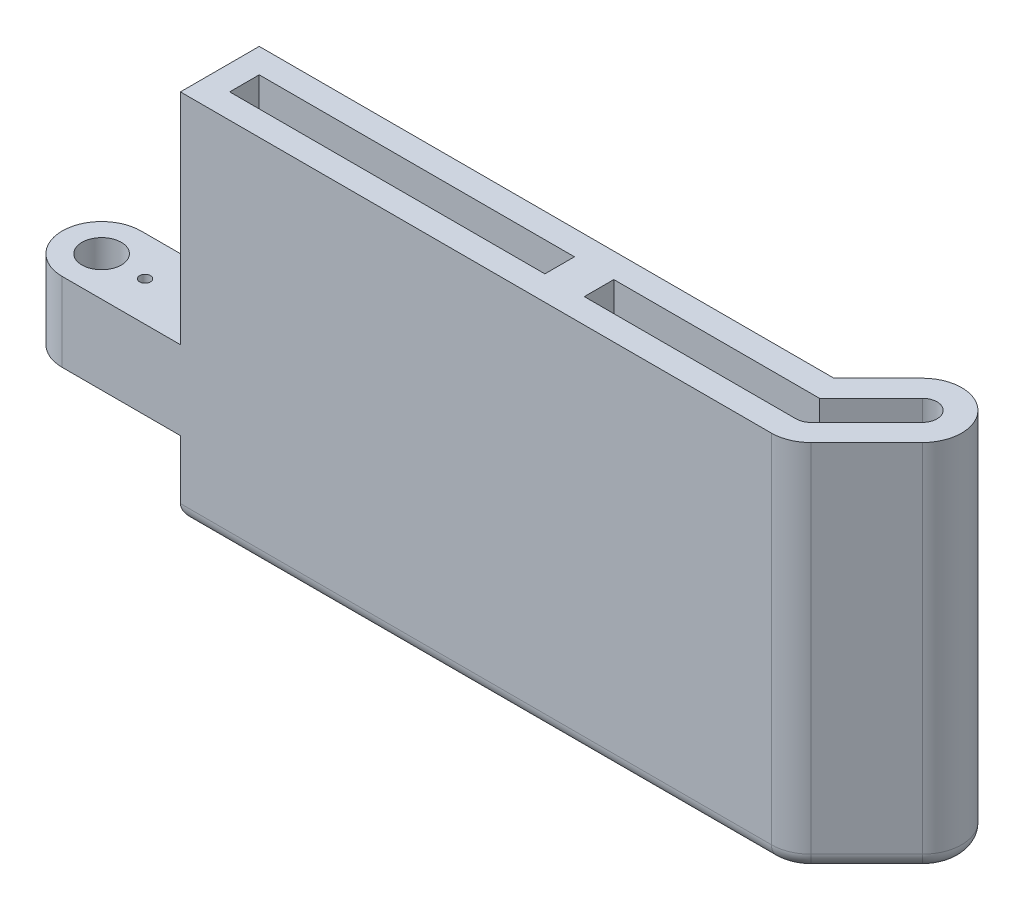
ISO-10303-21;
HEADER;
FILE_DESCRIPTION(('STEP AP214'),'2;1');
FILE_NAME('part.step','',(''),(''),'','','');
FILE_SCHEMA(('AUTOMOTIVE_DESIGN { 1 0 10303 214 1 1 1 1 }'));
ENDSEC;
DATA;
#1=APPLICATION_CONTEXT('core data for automotive mechanical design processes');
#2=APPLICATION_PROTOCOL_DEFINITION('international standard','automotive_design',2000,#1);
#3=PRODUCT_CONTEXT('',#1,'mechanical');
#4=PRODUCT('Part','Part','',(#3));
#5=PRODUCT_RELATED_PRODUCT_CATEGORY('part','',(#4));
#6=PRODUCT_DEFINITION_FORMATION('','',#4);
#7=PRODUCT_DEFINITION_CONTEXT('part definition',#1,'design');
#8=PRODUCT_DEFINITION('design','',#6,#7);
#9=PRODUCT_DEFINITION_SHAPE('','',#8);
#10=(LENGTH_UNIT() NAMED_UNIT(*) SI_UNIT(.MILLI.,.METRE.));
#11=(NAMED_UNIT(*) PLANE_ANGLE_UNIT() SI_UNIT($,.RADIAN.));
#12=(NAMED_UNIT(*) SI_UNIT($,.STERADIAN.) SOLID_ANGLE_UNIT());
#13=UNCERTAINTY_MEASURE_WITH_UNIT(LENGTH_MEASURE(1.E-05),#10,'distance_accuracy_value','');
#14=(GEOMETRIC_REPRESENTATION_CONTEXT(3) GLOBAL_UNCERTAINTY_ASSIGNED_CONTEXT((#13)) GLOBAL_UNIT_ASSIGNED_CONTEXT((#10,
#11,#12)) REPRESENTATION_CONTEXT('',''));
#15=CARTESIAN_POINT('',(0.,0.,0.));
#16=DIRECTION('',(0.,0.,1.));
#17=DIRECTION('',(1.,0.,0.));
#18=AXIS2_PLACEMENT_3D('',#15,#16,#17);
#19=CARTESIAN_POINT('',(61.6401280605348,59.999999888,61.6401280605346));
#20=DIRECTION('',(0.707106781186549,0.,0.707106781186546));
#21=DIRECTION('',(-0.707106781186546,0.,0.707106781186549));
#22=AXIS2_PLACEMENT_3D('',#19,#20,#21);
#23=PLANE('',#22);
#24=DIRECTION('',(0.,-1.,0.));
#25=VECTOR('',#24,1.);
#26=CARTESIAN_POINT('',(127.770384181604,59.999999888,-4.49012806053458));
#27=LINE('',#26,#25);
#28=CARTESIAN_POINT('',(127.770384181604,59.999999888,-4.49012806053458));
#29=VERTEX_POINT('',#28);
#30=CARTESIAN_POINT('',(127.770384181604,2.54,-4.49012806053458));
#31=VERTEX_POINT('',#30);
#32=EDGE_CURVE('E374',#29,#31,#27,.T.);
#33=ORIENTED_EDGE('',*,*,#32,.F.);
#34=DIRECTION('',(0.707106781186546,0.,-0.707106781186549));
#35=VECTOR('',#34,1.);
#36=CARTESIAN_POINT('',(61.6401280605348,59.999999888,61.6401280605346));
#37=LINE('',#36,#35);
#38=CARTESIAN_POINT('',(118.790128060535,59.999999888,4.49012806053457));
#39=VERTEX_POINT('',#38);
#40=EDGE_CURVE('E358',#39,#29,#37,.T.);
#41=ORIENTED_EDGE('',*,*,#40,.F.);
#42=DIRECTION('',(0.,-1.,0.));
#43=VECTOR('',#42,1.);
#44=CARTESIAN_POINT('',(118.790128060535,59.999999888,4.49012806053457));
#45=LINE('',#44,#43);
#46=CARTESIAN_POINT('',(118.790128060535,2.54,4.49012806053457));
#47=VERTEX_POINT('',#46);
#48=EDGE_CURVE('E392',#39,#47,#45,.T.);
#49=ORIENTED_EDGE('',*,*,#48,.T.);
#50=DIRECTION('',(0.707106781186546,0.,-0.707106781186549));
#51=VECTOR('',#50,1.);
#52=CARTESIAN_POINT('',(118.790128060535,2.54,4.49012806053457));
#53=LINE('',#52,#51);
#54=EDGE_CURVE('E429',#31,#47,#53,.F.);
#55=ORIENTED_EDGE('',*,*,#54,.F.);
#56=EDGE_LOOP('',(#33,#41,#49,#55));
#57=FACE_BOUND('',#56,.T.);
#58=ADVANCED_FACE('F41',(#57),#23,.T.);
#59=CARTESIAN_POINT('',(114.3,59.999999888,0.));
#60=DIRECTION('',(0.,-1.,0.));
#61=DIRECTION('',(0.,0.,1.));
#62=AXIS2_PLACEMENT_3D('',#59,#60,#61);
#63=CYLINDRICAL_SURFACE('',#62,6.35);
#64=ORIENTED_EDGE('',*,*,#48,.F.);
#65=CARTESIAN_POINT('',(114.3,59.999999888,0.));
#66=DIRECTION('',(0.,-1.,0.));
#67=DIRECTION('',(0.,0.,-1.));
#68=AXIS2_PLACEMENT_3D('',#65,#66,#67);
#69=CIRCLE('',#68,6.35);
#70=CARTESIAN_POINT('',(114.3,59.999999888,6.35));
#71=VERTEX_POINT('',#70);
#72=EDGE_CURVE('E361',#39,#71,#69,.T.);
#73=ORIENTED_EDGE('',*,*,#72,.T.);
#74=DIRECTION('',(0.,-1.,0.));
#75=VECTOR('',#74,1.);
#76=CARTESIAN_POINT('',(114.3,59.999999888,6.35));
#77=LINE('',#76,#75);
#78=CARTESIAN_POINT('',(114.3,2.54,6.35));
#79=VERTEX_POINT('',#78);
#80=EDGE_CURVE('E389',#71,#79,#77,.T.);
#81=ORIENTED_EDGE('',*,*,#80,.T.);
#82=CARTESIAN_POINT('',(114.3,2.54,0.));
#83=DIRECTION('',(0.,-1.,0.));
#84=DIRECTION('',(0.,0.,-1.));
#85=AXIS2_PLACEMENT_3D('',#82,#83,#84);
#86=CIRCLE('',#85,6.35);
#87=EDGE_CURVE('E426',#47,#79,#86,.T.);
#88=ORIENTED_EDGE('',*,*,#87,.F.);
#89=EDGE_LOOP('',(#64,#73,#81,#88));
#90=FACE_BOUND('',#89,.T.);
#91=ADVANCED_FACE('F489',(#90),#63,.T.);
#92=CARTESIAN_POINT('',(0.,59.999999888,6.35));
#93=DIRECTION('',(0.,0.,1.));
#94=DIRECTION('',(-1.,0.,0.));
#95=AXIS2_PLACEMENT_3D('',#92,#93,#94);
#96=PLANE('',#95);
#97=ORIENTED_EDGE('',*,*,#80,.F.);
#98=DIRECTION('',(1.,0.,0.));
#99=VECTOR('',#98,1.);
#100=CARTESIAN_POINT('',(0.,59.999999888,6.35));
#101=LINE('',#100,#99);
#102=CARTESIAN_POINT('',(19.05,59.999999888,6.35));
#103=VERTEX_POINT('',#102);
#104=EDGE_CURVE('E364',#103,#71,#101,.T.);
#105=ORIENTED_EDGE('',*,*,#104,.F.);
#106=DIRECTION('',(0.,1.,0.));
#107=VECTOR('',#106,1.);
#108=CARTESIAN_POINT('',(19.05,59.999999888,6.35));
#109=LINE('',#108,#107);
#110=CARTESIAN_POINT('',(19.05,24.717000096,6.35));
#111=VERTEX_POINT('',#110);
#112=EDGE_CURVE('E340',#111,#103,#109,.T.);
#113=ORIENTED_EDGE('',*,*,#112,.F.);
#114=DIRECTION('',(1.,0.,0.));
#115=VECTOR('',#114,1.);
#116=CARTESIAN_POINT('',(-6.34999999999999,24.717000096,6.35));
#117=LINE('',#116,#115);
#118=CARTESIAN_POINT('',(0.,24.717000096,6.35));
#119=VERTEX_POINT('',#118);
#120=EDGE_CURVE('E347',#119,#111,#117,.T.);
#121=ORIENTED_EDGE('',*,*,#120,.F.);
#122=DIRECTION('',(0.,-1.,0.));
#123=VECTOR('',#122,1.);
#124=CARTESIAN_POINT('',(0.,59.999999888,6.35));
#125=LINE('',#124,#123);
#126=CARTESIAN_POINT('',(0.,12.017000096,6.35));
#127=VERTEX_POINT('',#126);
#128=EDGE_CURVE('E386',#119,#127,#125,.T.);
#129=ORIENTED_EDGE('',*,*,#128,.T.);
#130=DIRECTION('',(-1.,0.,0.));
#131=VECTOR('',#130,1.);
#132=CARTESIAN_POINT('',(-6.35,12.017000096,6.35));
#133=LINE('',#132,#131);
#134=CARTESIAN_POINT('',(19.05,12.017000096,6.35));
#135=VERTEX_POINT('',#134);
#136=EDGE_CURVE('E326',#135,#127,#133,.T.);
#137=ORIENTED_EDGE('',*,*,#136,.F.);
#138=DIRECTION('',(0.,1.,0.));
#139=VECTOR('',#138,1.);
#140=CARTESIAN_POINT('',(19.05,12.017000096,6.35));
#141=LINE('',#140,#139);
#142=CARTESIAN_POINT('',(19.05,2.54,6.35));
#143=VERTEX_POINT('',#142);
#144=EDGE_CURVE('E323',#143,#135,#141,.T.);
#145=ORIENTED_EDGE('',*,*,#144,.F.);
#146=DIRECTION('',(1.,0.,0.));
#147=VECTOR('',#146,1.);
#148=CARTESIAN_POINT('',(19.05,2.54,6.35));
#149=LINE('',#148,#147);
#150=EDGE_CURVE('E432',#79,#143,#149,.F.);
#151=ORIENTED_EDGE('',*,*,#150,.F.);
#152=EDGE_LOOP('',(#97,#105,#113,#121,#129,#137,#145,#151));
#153=FACE_BOUND('',#152,.T.);
#154=ADVANCED_FACE('F461',(#153),#96,.T.);
#155=CARTESIAN_POINT('',(0.,59.999999888,0.));
#156=DIRECTION('',(0.,-1.,0.));
#157=DIRECTION('',(0.,0.,1.));
#158=AXIS2_PLACEMENT_3D('',#155,#156,#157);
#159=CYLINDRICAL_SURFACE('',#158,6.35);
#160=ORIENTED_EDGE('',*,*,#128,.F.);
#161=CARTESIAN_POINT('',(0.,24.717000096,0.));
#162=DIRECTION('',(0.,1.,0.));
#163=DIRECTION('',(1.,0.,0.));
#164=AXIS2_PLACEMENT_3D('',#161,#162,#163);
#165=CIRCLE('',#164,6.35);
#166=CARTESIAN_POINT('',(0.,24.717000096,-6.35));
#167=VERTEX_POINT('',#166);
#168=EDGE_CURVE('E337',#167,#119,#165,.T.);
#169=ORIENTED_EDGE('',*,*,#168,.F.);
#170=DIRECTION('',(0.,-1.,0.));
#171=VECTOR('',#170,1.);
#172=CARTESIAN_POINT('',(0.,59.999999888,-6.35));
#173=LINE('',#172,#171);
#174=CARTESIAN_POINT('',(0.,12.017000096,-6.35));
#175=VERTEX_POINT('',#174);
#176=EDGE_CURVE('E383',#167,#175,#173,.T.);
#177=ORIENTED_EDGE('',*,*,#176,.T.);
#178=CARTESIAN_POINT('',(0.,12.017000096,0.));
#179=DIRECTION('',(0.,-1.,0.));
#180=DIRECTION('',(0.,0.,-1.));
#181=AXIS2_PLACEMENT_3D('',#178,#179,#180);
#182=CIRCLE('',#181,6.35);
#183=EDGE_CURVE('E355',#127,#175,#182,.T.);
#184=ORIENTED_EDGE('',*,*,#183,.F.);
#185=EDGE_LOOP('',(#160,#169,#177,#184));
#186=FACE_BOUND('',#185,.T.);
#187=ADVANCED_FACE('F504',(#186),#159,.T.);
#188=CARTESIAN_POINT('',(0.,59.999999888,-6.35));
#189=DIRECTION('',(0.,0.,1.));
#190=DIRECTION('',(-1.,0.,0.));
#191=AXIS2_PLACEMENT_3D('',#188,#189,#190);
#192=PLANE('',#191);
#193=DIRECTION('',(0.,1.,0.));
#194=VECTOR('',#193,1.);
#195=CARTESIAN_POINT('',(19.05,12.017000096,-6.35));
#196=LINE('',#195,#194);
#197=CARTESIAN_POINT('',(19.05,2.54,-6.35));
#198=VERTEX_POINT('',#197);
#199=CARTESIAN_POINT('',(19.05,12.017000096,-6.35));
#200=VERTEX_POINT('',#199);
#201=EDGE_CURVE('E331',#198,#200,#196,.T.);
#202=ORIENTED_EDGE('',*,*,#201,.T.);
#203=DIRECTION('',(-1.,0.,0.));
#204=VECTOR('',#203,1.);
#205=CARTESIAN_POINT('',(-6.35,12.017000096,-6.35));
#206=LINE('',#205,#204);
#207=EDGE_CURVE('E327',#200,#175,#206,.T.);
#208=ORIENTED_EDGE('',*,*,#207,.T.);
#209=ORIENTED_EDGE('',*,*,#176,.F.);
#210=DIRECTION('',(1.,0.,0.));
#211=VECTOR('',#210,1.);
#212=CARTESIAN_POINT('',(-6.34999999999999,24.717000096,-6.35));
#213=LINE('',#212,#211);
#214=CARTESIAN_POINT('',(19.05,24.717000096,-6.35));
#215=VERTEX_POINT('',#214);
#216=EDGE_CURVE('E334',#167,#215,#213,.T.);
#217=ORIENTED_EDGE('',*,*,#216,.T.);
#218=DIRECTION('',(0.,1.,0.));
#219=VECTOR('',#218,1.);
#220=CARTESIAN_POINT('',(19.05,59.999999888,-6.35));
#221=LINE('',#220,#219);
#222=CARTESIAN_POINT('',(19.05,59.999999888,-6.35));
#223=VERTEX_POINT('',#222);
#224=EDGE_CURVE('E344',#215,#223,#221,.T.);
#225=ORIENTED_EDGE('',*,*,#224,.T.);
#226=DIRECTION('',(1.,0.,0.));
#227=VECTOR('',#226,1.);
#228=CARTESIAN_POINT('',(0.,59.999999888,-6.35));
#229=LINE('',#228,#227);
#230=CARTESIAN_POINT('',(111.669743878931,59.999999888,-6.35));
#231=VERTEX_POINT('',#230);
#232=EDGE_CURVE('E366',#223,#231,#229,.T.);
#233=ORIENTED_EDGE('',*,*,#232,.T.);
#234=DIRECTION('',(0.,-1.,0.));
#235=VECTOR('',#234,1.);
#236=CARTESIAN_POINT('',(111.669743878931,59.999999888,-6.35));
#237=LINE('',#236,#235);
#238=CARTESIAN_POINT('',(111.669743878931,2.54,-6.35));
#239=VERTEX_POINT('',#238);
#240=EDGE_CURVE('E380',#231,#239,#237,.T.);
#241=ORIENTED_EDGE('',*,*,#240,.T.);
#242=DIRECTION('',(1.,0.,0.));
#243=VECTOR('',#242,1.);
#244=CARTESIAN_POINT('',(0.,2.54,-6.35));
#245=LINE('',#244,#243);
#246=EDGE_CURVE('E11',#198,#239,#245,.T.);
#247=ORIENTED_EDGE('',*,*,#246,.F.);
#248=EDGE_LOOP('',(#202,#208,#209,#217,#225,#233,#241,#247));
#249=FACE_BOUND('',#248,.T.);
#250=ADVANCED_FACE('F467',(#249),#192,.F.);
#251=CARTESIAN_POINT('',(52.6598719394656,59.999999888,52.6598719394654));
#252=DIRECTION('',(0.707106781186549,0.,0.707106781186546));
#253=DIRECTION('',(-0.707106781186546,0.,0.707106781186549));
#254=AXIS2_PLACEMENT_3D('',#251,#252,#253);
#255=PLANE('',#254);
#256=ORIENTED_EDGE('',*,*,#240,.F.);
#257=DIRECTION('',(0.707106781186546,0.,-0.707106781186549));
#258=VECTOR('',#257,1.);
#259=CARTESIAN_POINT('',(52.6598719394656,59.999999888,52.6598719394654));
#260=LINE('',#259,#258);
#261=CARTESIAN_POINT('',(118.790128060535,59.999999888,-13.4703841816037));
#262=VERTEX_POINT('',#261);
#263=EDGE_CURVE('E369',#231,#262,#260,.T.);
#264=ORIENTED_EDGE('',*,*,#263,.T.);
#265=DIRECTION('',(0.,-1.,0.));
#266=VECTOR('',#265,1.);
#267=CARTESIAN_POINT('',(118.790128060535,59.999999888,-13.4703841816037));
#268=LINE('',#267,#266);
#269=CARTESIAN_POINT('',(118.790128060535,2.54,-13.4703841816037));
#270=VERTEX_POINT('',#269);
#271=EDGE_CURVE('E377',#262,#270,#268,.T.);
#272=ORIENTED_EDGE('',*,*,#271,.T.);
#273=DIRECTION('',(0.707106781186546,0.,-0.707106781186549));
#274=VECTOR('',#273,1.);
#275=CARTESIAN_POINT('',(52.6598719394656,2.54,52.6598719394654));
#276=LINE('',#275,#274);
#277=EDGE_CURVE('E423',#239,#270,#276,.T.);
#278=ORIENTED_EDGE('',*,*,#277,.F.);
#279=EDGE_LOOP('',(#256,#264,#272,#278));
#280=FACE_BOUND('',#279,.T.);
#281=ADVANCED_FACE('F473',(#280),#255,.F.);
#282=CARTESIAN_POINT('',(123.280256121069,59.999999888,-8.98025612106917));
#283=DIRECTION('',(0.,-1.,0.));
#284=DIRECTION('',(0.,0.,1.));
#285=AXIS2_PLACEMENT_3D('',#282,#283,#284);
#286=CYLINDRICAL_SURFACE('',#285,6.35);
#287=ORIENTED_EDGE('',*,*,#271,.F.);
#288=CARTESIAN_POINT('',(123.280256121069,59.999999888,-8.98025612106917));
#289=DIRECTION('',(0.,-1.,0.));
#290=DIRECTION('',(0.,0.,-1.));
#291=AXIS2_PLACEMENT_3D('',#288,#289,#290);
#292=CIRCLE('',#291,6.35);
#293=EDGE_CURVE('E372',#262,#29,#292,.T.);
#294=ORIENTED_EDGE('',*,*,#293,.T.);
#295=ORIENTED_EDGE('',*,*,#32,.T.);
#296=CARTESIAN_POINT('',(123.280256121069,2.54,-8.98025612106917));
#297=DIRECTION('',(0.,-1.,0.));
#298=DIRECTION('',(0.,0.,-1.));
#299=AXIS2_PLACEMENT_3D('',#296,#297,#298);
#300=CIRCLE('',#299,6.35);
#301=EDGE_CURVE('E395',#270,#31,#300,.T.);
#302=ORIENTED_EDGE('',*,*,#301,.F.);
#303=EDGE_LOOP('',(#287,#294,#295,#302));
#304=FACE_BOUND('',#303,.T.);
#305=ADVANCED_FACE('F600',(#304),#286,.T.);
#306=CARTESIAN_POINT('',(0.,59.999999888,0.));
#307=DIRECTION('',(0.,1.,0.));
#308=DIRECTION('',(0.,0.,-1.));
#309=AXIS2_PLACEMENT_3D('',#306,#307,#308);
#310=PLANE('',#309);
#311=CARTESIAN_POINT('',(114.3,59.999999888,0.));
#312=DIRECTION('',(0.,-1.,0.));
#313=DIRECTION('',(0.,0.,-1.));
#314=AXIS2_PLACEMENT_3D('',#311,#312,#313);
#315=CIRCLE('',#314,2.38125000000001);
#316=CARTESIAN_POINT('',(115.9837980227,59.999999888,1.68379802270046));
#317=VERTEX_POINT('',#316);
#318=CARTESIAN_POINT('',(114.3,59.999999888,2.38125));
#319=VERTEX_POINT('',#318);
#320=EDGE_CURVE('E253',#317,#319,#315,.T.);
#321=ORIENTED_EDGE('',*,*,#320,.T.);
#322=DIRECTION('',(-1.,0.,0.));
#323=VECTOR('',#322,1.);
#324=CARTESIAN_POINT('',(114.3,59.999999888,2.38125));
#325=LINE('',#324,#323);
#326=CARTESIAN_POINT('',(80.16875,59.999999888,2.38125));
#327=VERTEX_POINT('',#326);
#328=EDGE_CURVE('E219',#319,#327,#325,.T.);
#329=ORIENTED_EDGE('',*,*,#328,.T.);
#330=DIRECTION('',(0.,0.,-1.));
#331=VECTOR('',#330,1.);
#332=CARTESIAN_POINT('',(80.16875,59.999999888,2.38125));
#333=LINE('',#332,#331);
#334=CARTESIAN_POINT('',(80.16875,59.999999888,-2.38125));
#335=VERTEX_POINT('',#334);
#336=EDGE_CURVE('E257',#327,#335,#333,.T.);
#337=ORIENTED_EDGE('',*,*,#336,.T.);
#338=DIRECTION('',(1.,0.,0.));
#339=VECTOR('',#338,1.);
#340=CARTESIAN_POINT('',(80.16875,59.999999888,-2.38125));
#341=LINE('',#340,#339);
#342=CARTESIAN_POINT('',(113.313653954599,59.999999888,-2.38125));
#343=VERTEX_POINT('',#342);
#344=EDGE_CURVE('E260',#335,#343,#341,.T.);
#345=ORIENTED_EDGE('',*,*,#344,.T.);
#346=DIRECTION('',(0.707106781186547,0.,-0.707106781186548));
#347=VECTOR('',#346,1.);
#348=CARTESIAN_POINT('',(113.313653954599,59.999999888,-2.38125));
#349=LINE('',#348,#347);
#350=CARTESIAN_POINT('',(121.596458098369,59.999999888,-10.6640541437696));
#351=VERTEX_POINT('',#350);
#352=EDGE_CURVE('E263',#343,#351,#349,.T.);
#353=ORIENTED_EDGE('',*,*,#352,.T.);
#354=CARTESIAN_POINT('',(123.280256121069,59.999999888,-8.98025612106917));
#355=DIRECTION('',(0.,-1.,0.));
#356=DIRECTION('',(0.,0.,-1.));
#357=AXIS2_PLACEMENT_3D('',#354,#355,#356);
#358=CIRCLE('',#357,2.38124999999998);
#359=CARTESIAN_POINT('',(124.96405414377,59.999999888,-7.2964580983687));
#360=VERTEX_POINT('',#359);
#361=EDGE_CURVE('E266',#351,#360,#358,.T.);
#362=ORIENTED_EDGE('',*,*,#361,.T.);
#363=DIRECTION('',(-0.707106781186545,0.,0.70710678118655));
#364=VECTOR('',#363,1.);
#365=CARTESIAN_POINT('',(124.96405414377,59.999999888,-7.2964580983687));
#366=LINE('',#365,#364);
#367=EDGE_CURVE('E233',#360,#317,#366,.T.);
#368=ORIENTED_EDGE('',*,*,#367,.T.);
#369=EDGE_LOOP('',(#321,#329,#337,#345,#353,#362,#368));
#370=FACE_BOUND('',#369,.T.);
#371=DIRECTION('',(-1.,0.,0.));
#372=VECTOR('',#371,1.);
#373=CARTESIAN_POINT('',(73.81875,59.999999888,2.38125));
#374=LINE('',#373,#372);
#375=CARTESIAN_POINT('',(73.81875,59.999999888,2.38125));
#376=VERTEX_POINT('',#375);
#377=CARTESIAN_POINT('',(23.01875,59.999999888,2.38125));
#378=VERTEX_POINT('',#377);
#379=EDGE_CURVE('E255',#376,#378,#374,.T.);
#380=ORIENTED_EDGE('',*,*,#379,.T.);
#381=DIRECTION('',(0.,0.,-1.));
#382=VECTOR('',#381,1.);
#383=CARTESIAN_POINT('',(23.01875,59.999999888,2.38125));
#384=LINE('',#383,#382);
#385=CARTESIAN_POINT('',(23.01875,59.999999888,-2.38125));
#386=VERTEX_POINT('',#385);
#387=EDGE_CURVE('E298',#378,#386,#384,.T.);
#388=ORIENTED_EDGE('',*,*,#387,.T.);
#389=DIRECTION('',(1.,0.,0.));
#390=VECTOR('',#389,1.);
#391=CARTESIAN_POINT('',(23.01875,59.999999888,-2.38125));
#392=LINE('',#391,#390);
#393=CARTESIAN_POINT('',(73.81875,59.999999888,-2.38125));
#394=VERTEX_POINT('',#393);
#395=EDGE_CURVE('E294',#386,#394,#392,.T.);
#396=ORIENTED_EDGE('',*,*,#395,.T.);
#397=DIRECTION('',(0.,0.,1.));
#398=VECTOR('',#397,1.);
#399=CARTESIAN_POINT('',(73.81875,59.999999888,2.38125));
#400=LINE('',#399,#398);
#401=EDGE_CURVE('E291',#394,#376,#400,.T.);
#402=ORIENTED_EDGE('',*,*,#401,.T.);
#403=EDGE_LOOP('',(#380,#388,#396,#402));
#404=FACE_BOUND('',#403,.T.);
#405=DIRECTION('',(0.,0.,-1.));
#406=VECTOR('',#405,1.);
#407=CARTESIAN_POINT('',(19.05,59.999999888,6.35));
#408=LINE('',#407,#406);
#409=EDGE_CURVE('E341',#103,#223,#408,.T.);
#410=ORIENTED_EDGE('',*,*,#409,.F.);
#411=ORIENTED_EDGE('',*,*,#104,.T.);
#412=ORIENTED_EDGE('',*,*,#72,.F.);
#413=ORIENTED_EDGE('',*,*,#40,.T.);
#414=ORIENTED_EDGE('',*,*,#293,.F.);
#415=ORIENTED_EDGE('',*,*,#263,.F.);
#416=ORIENTED_EDGE('',*,*,#232,.F.);
#417=EDGE_LOOP('',(#410,#411,#412,#413,#414,#415,#416));
#418=FACE_BOUND('',#417,.T.);
#419=ADVANCED_FACE('F495',(#370,#404,#418),#310,.T.);
#420=CARTESIAN_POINT('',(0.,0.,0.));
#421=DIRECTION('',(0.,1.,0.));
#422=DIRECTION('',(0.,0.,-1.));
#423=AXIS2_PLACEMENT_3D('',#420,#421,#422);
#424=PLANE('',#423);
#425=CARTESIAN_POINT('',(114.3,0.,0.));
#426=DIRECTION('',(0.,-1.,0.));
#427=DIRECTION('',(0.,0.,-1.));
#428=AXIS2_PLACEMENT_3D('',#425,#426,#427);
#429=CIRCLE('',#428,3.81);
#430=CARTESIAN_POINT('',(114.3,0.,3.81));
#431=VERTEX_POINT('',#430);
#432=CARTESIAN_POINT('',(116.994076836321,0.,2.69407683632074));
#433=VERTEX_POINT('',#432);
#434=EDGE_CURVE('E411',#431,#433,#429,.F.);
#435=ORIENTED_EDGE('',*,*,#434,.F.);
#436=DIRECTION('',(1.,0.,0.));
#437=VECTOR('',#436,1.);
#438=CARTESIAN_POINT('',(114.3,0.,3.81));
#439=LINE('',#438,#437);
#440=CARTESIAN_POINT('',(21.59,0.,3.81));
#441=VERTEX_POINT('',#440);
#442=EDGE_CURVE('E408',#441,#431,#439,.T.);
#443=ORIENTED_EDGE('',*,*,#442,.F.);
#444=DIRECTION('',(0.,0.,-1.));
#445=VECTOR('',#444,1.);
#446=CARTESIAN_POINT('',(21.59,0.,0.));
#447=LINE('',#446,#445);
#448=CARTESIAN_POINT('',(21.59,0.,-3.81));
#449=VERTEX_POINT('',#448);
#450=EDGE_CURVE('E406',#449,#441,#447,.F.);
#451=ORIENTED_EDGE('',*,*,#450,.F.);
#452=DIRECTION('',(1.,0.,0.));
#453=VECTOR('',#452,1.);
#454=CARTESIAN_POINT('',(0.,0.,-3.81));
#455=LINE('',#454,#453);
#456=CARTESIAN_POINT('',(112.721846327359,0.,-3.81));
#457=VERTEX_POINT('',#456);
#458=EDGE_CURVE('E404',#457,#449,#455,.F.);
#459=ORIENTED_EDGE('',*,*,#458,.F.);
#460=DIRECTION('',(0.707106781186546,0.,-0.707106781186549));
#461=VECTOR('',#460,1.);
#462=CARTESIAN_POINT('',(54.4559231636795,0.,54.4559231636793));
#463=LINE('',#462,#461);
#464=CARTESIAN_POINT('',(120.586179284748,0.,-11.6743329573899));
#465=VERTEX_POINT('',#464);
#466=EDGE_CURVE('E414',#465,#457,#463,.F.);
#467=ORIENTED_EDGE('',*,*,#466,.F.);
#468=CARTESIAN_POINT('',(123.280256121069,0.,-8.98025612106917));
#469=DIRECTION('',(0.,-1.,0.));
#470=DIRECTION('',(0.,0.,-1.));
#471=AXIS2_PLACEMENT_3D('',#468,#469,#470);
#472=CIRCLE('',#471,3.81);
#473=CARTESIAN_POINT('',(125.97433295739,0.,-6.28617928474842));
#474=VERTEX_POINT('',#473);
#475=EDGE_CURVE('E417',#474,#465,#472,.F.);
#476=ORIENTED_EDGE('',*,*,#475,.F.);
#477=DIRECTION('',(0.707106781186546,0.,-0.707106781186549));
#478=VECTOR('',#477,1.);
#479=CARTESIAN_POINT('',(125.97433295739,0.,-6.28617928474841));
#480=LINE('',#479,#478);
#481=EDGE_CURVE('E420',#433,#474,#480,.T.);
#482=ORIENTED_EDGE('',*,*,#481,.F.);
#483=EDGE_LOOP('',(#435,#443,#451,#459,#467,#476,#482));
#484=FACE_BOUND('',#483,.T.);
#485=DIRECTION('',(-0.707106781186545,0.,0.70710678118655));
#486=VECTOR('',#485,1.);
#487=CARTESIAN_POINT('',(124.96405414377,0.,-7.2964580983687));
#488=LINE('',#487,#486);
#489=CARTESIAN_POINT('',(124.96405414377,0.,-7.2964580983687));
#490=VERTEX_POINT('',#489);
#491=CARTESIAN_POINT('',(115.9837980227,0.,1.68379802270046));
#492=VERTEX_POINT('',#491);
#493=EDGE_CURVE('E224',#490,#492,#488,.T.);
#494=ORIENTED_EDGE('',*,*,#493,.F.);
#495=CARTESIAN_POINT('',(123.280256121069,0.,-8.98025612106917));
#496=DIRECTION('',(0.,-1.,0.));
#497=DIRECTION('',(0.,0.,-1.));
#498=AXIS2_PLACEMENT_3D('',#495,#496,#497);
#499=CIRCLE('',#498,2.38124999999998);
#500=CARTESIAN_POINT('',(121.596458098369,0.,-10.6640541437696));
#501=VERTEX_POINT('',#500);
#502=EDGE_CURVE('E249',#501,#490,#499,.T.);
#503=ORIENTED_EDGE('',*,*,#502,.F.);
#504=DIRECTION('',(0.707106781186547,0.,-0.707106781186548));
#505=VECTOR('',#504,1.);
#506=CARTESIAN_POINT('',(113.313653954599,0.,-2.38125));
#507=LINE('',#506,#505);
#508=CARTESIAN_POINT('',(113.313653954599,0.,-2.38125));
#509=VERTEX_POINT('',#508);
#510=EDGE_CURVE('E246',#509,#501,#507,.T.);
#511=ORIENTED_EDGE('',*,*,#510,.F.);
#512=DIRECTION('',(1.,0.,0.));
#513=VECTOR('',#512,1.);
#514=CARTESIAN_POINT('',(80.16875,0.,-2.38125));
#515=LINE('',#514,#513);
#516=CARTESIAN_POINT('',(80.16875,0.,-2.38125));
#517=VERTEX_POINT('',#516);
#518=EDGE_CURVE('E241',#517,#509,#515,.T.);
#519=ORIENTED_EDGE('',*,*,#518,.F.);
#520=DIRECTION('',(0.,0.,-1.));
#521=VECTOR('',#520,1.);
#522=CARTESIAN_POINT('',(80.16875,0.,2.38125));
#523=LINE('',#522,#521);
#524=CARTESIAN_POINT('',(80.16875,0.,2.38125));
#525=VERTEX_POINT('',#524);
#526=EDGE_CURVE('E239',#525,#517,#523,.T.);
#527=ORIENTED_EDGE('',*,*,#526,.F.);
#528=DIRECTION('',(-1.,0.,0.));
#529=VECTOR('',#528,1.);
#530=CARTESIAN_POINT('',(114.3,0.,2.38125));
#531=LINE('',#530,#529);
#532=CARTESIAN_POINT('',(114.3,0.,2.38125));
#533=VERTEX_POINT('',#532);
#534=EDGE_CURVE('E216',#533,#525,#531,.T.);
#535=ORIENTED_EDGE('',*,*,#534,.F.);
#536=CARTESIAN_POINT('',(114.3,0.,0.));
#537=DIRECTION('',(0.,-1.,0.));
#538=DIRECTION('',(0.,0.,-1.));
#539=AXIS2_PLACEMENT_3D('',#536,#537,#538);
#540=CIRCLE('',#539,2.38125000000001);
#541=EDGE_CURVE('E227',#492,#533,#540,.T.);
#542=ORIENTED_EDGE('',*,*,#541,.F.);
#543=EDGE_LOOP('',(#494,#503,#511,#519,#527,#535,#542));
#544=FACE_BOUND('',#543,.T.);
#545=DIRECTION('',(0.,0.,1.));
#546=VECTOR('',#545,1.);
#547=CARTESIAN_POINT('',(73.81875,0.,2.38125));
#548=LINE('',#547,#546);
#549=CARTESIAN_POINT('',(73.81875,0.,-2.38125));
#550=VERTEX_POINT('',#549);
#551=CARTESIAN_POINT('',(73.81875,0.,2.38125));
#552=VERTEX_POINT('',#551);
#553=EDGE_CURVE('E284',#550,#552,#548,.T.);
#554=ORIENTED_EDGE('',*,*,#553,.F.);
#555=DIRECTION('',(1.,0.,0.));
#556=VECTOR('',#555,1.);
#557=CARTESIAN_POINT('',(23.01875,0.,-2.38125));
#558=LINE('',#557,#556);
#559=CARTESIAN_POINT('',(23.01875,0.,-2.38125));
#560=VERTEX_POINT('',#559);
#561=EDGE_CURVE('E305',#560,#550,#558,.T.);
#562=ORIENTED_EDGE('',*,*,#561,.F.);
#563=DIRECTION('',(0.,0.,-1.));
#564=VECTOR('',#563,1.);
#565=CARTESIAN_POINT('',(23.01875,0.,2.38125));
#566=LINE('',#565,#564);
#567=CARTESIAN_POINT('',(23.01875,0.,2.38125));
#568=VERTEX_POINT('',#567);
#569=EDGE_CURVE('E308',#568,#560,#566,.T.);
#570=ORIENTED_EDGE('',*,*,#569,.F.);
#571=DIRECTION('',(-1.,0.,0.));
#572=VECTOR('',#571,1.);
#573=CARTESIAN_POINT('',(73.81875,0.,2.38125));
#574=LINE('',#573,#572);
#575=EDGE_CURVE('E295',#552,#568,#574,.T.);
#576=ORIENTED_EDGE('',*,*,#575,.F.);
#577=EDGE_LOOP('',(#554,#562,#570,#576));
#578=FACE_BOUND('',#577,.T.);
#579=ADVANCED_FACE('F235',(#484,#544,#578),#424,.F.);
#580=CARTESIAN_POINT('',(-6.35,12.017000096,6.35));
#581=DIRECTION('',(0.,1.,0.));
#582=DIRECTION('',(0.,0.,-1.));
#583=AXIS2_PLACEMENT_3D('',#580,#581,#582);
#584=PLANE('',#583);
#585=CARTESIAN_POINT('',(0.,12.017000096,0.));
#586=DIRECTION('',(0.,1.,0.));
#587=DIRECTION('',(0.,0.,1.));
#588=AXIS2_PLACEMENT_3D('',#585,#586,#587);
#589=CIRCLE('',#588,3.175);
#590=CARTESIAN_POINT('',(0.,12.017000096,3.175));
#591=VERTEX_POINT('',#590);
#592=EDGE_CURVE('E272',#591,#591,#589,.T.);
#593=ORIENTED_EDGE('',*,*,#592,.T.);
#594=EDGE_LOOP('',(#593));
#595=FACE_BOUND('',#594,.T.);
#596=CARTESIAN_POINT('',(6.99999997,12.017000096,0.));
#597=DIRECTION('',(0.,1.,0.));
#598=DIRECTION('',(0.,0.,1.));
#599=AXIS2_PLACEMENT_3D('',#596,#597,#598);
#600=CIRCLE('',#599,0.877000024);
#601=CARTESIAN_POINT('',(6.99999997,12.017000096,0.877000024));
#602=VERTEX_POINT('',#601);
#603=EDGE_CURVE('E316',#602,#602,#600,.T.);
#604=ORIENTED_EDGE('',*,*,#603,.T.);
#605=EDGE_LOOP('',(#604));
#606=FACE_BOUND('',#605,.T.);
#607=CARTESIAN_POINT('',(16.000000004,12.017000096,0.));
#608=DIRECTION('',(0.,1.,0.));
#609=DIRECTION('',(0.,0.,1.));
#610=AXIS2_PLACEMENT_3D('',#607,#608,#609);
#611=CIRCLE('',#610,0.877000023999999);
#612=CARTESIAN_POINT('',(16.000000004,12.017000096,0.877000023999999));
#613=VERTEX_POINT('',#612);
#614=EDGE_CURVE('E320',#613,#613,#611,.T.);
#615=ORIENTED_EDGE('',*,*,#614,.T.);
#616=EDGE_LOOP('',(#615));
#617=FACE_BOUND('',#616,.T.);
#618=ORIENTED_EDGE('',*,*,#136,.T.);
#619=ORIENTED_EDGE('',*,*,#183,.T.);
#620=ORIENTED_EDGE('',*,*,#207,.F.);
#621=DIRECTION('',(0.,0.,-1.));
#622=VECTOR('',#621,1.);
#623=CARTESIAN_POINT('',(19.05,12.017000096,6.35));
#624=LINE('',#623,#622);
#625=EDGE_CURVE('E330',#135,#200,#624,.T.);
#626=ORIENTED_EDGE('',*,*,#625,.F.);
#627=EDGE_LOOP('',(#618,#619,#620,#626));
#628=FACE_BOUND('',#627,.T.);
#629=ADVANCED_FACE('F506',(#595,#606,#617,#628),#584,.F.);
#630=CARTESIAN_POINT('',(19.05,12.017000096,6.35));
#631=DIRECTION('',(1.,0.,0.));
#632=DIRECTION('',(0.,1.,0.));
#633=AXIS2_PLACEMENT_3D('',#630,#631,#632);
#634=PLANE('',#633);
#635=ORIENTED_EDGE('',*,*,#144,.T.);
#636=ORIENTED_EDGE('',*,*,#625,.T.);
#637=ORIENTED_EDGE('',*,*,#201,.F.);
#638=DIRECTION('',(0.,0.,-1.));
#639=VECTOR('',#638,1.);
#640=CARTESIAN_POINT('',(19.05,2.54,6.35));
#641=LINE('',#640,#639);
#642=EDGE_CURVE('E50',#143,#198,#641,.T.);
#643=ORIENTED_EDGE('',*,*,#642,.F.);
#644=EDGE_LOOP('',(#635,#636,#637,#643));
#645=FACE_BOUND('',#644,.T.);
#646=ADVANCED_FACE('F463',(#645),#634,.F.);
#647=CARTESIAN_POINT('',(-6.34999999999999,24.717000096,6.35));
#648=DIRECTION('',(0.,-1.,0.));
#649=DIRECTION('',(1.,0.,0.));
#650=AXIS2_PLACEMENT_3D('',#647,#648,#649);
#651=PLANE('',#650);
#652=CARTESIAN_POINT('',(0.,24.717000096,0.));
#653=DIRECTION('',(0.,1.,0.));
#654=DIRECTION('',(1.,0.,0.));
#655=AXIS2_PLACEMENT_3D('',#652,#653,#654);
#656=CIRCLE('',#655,3.175);
#657=CARTESIAN_POINT('',(3.175,24.717000096,0.));
#658=VERTEX_POINT('',#657);
#659=EDGE_CURVE('E315',#658,#658,#656,.T.);
#660=ORIENTED_EDGE('',*,*,#659,.F.);
#661=EDGE_LOOP('',(#660));
#662=FACE_BOUND('',#661,.T.);
#663=CARTESIAN_POINT('',(6.99999997,24.717000096,0.));
#664=DIRECTION('',(0.,1.,0.));
#665=DIRECTION('',(1.,0.,0.));
#666=AXIS2_PLACEMENT_3D('',#663,#664,#665);
#667=CIRCLE('',#666,0.877000024);
#668=CARTESIAN_POINT('',(7.876999994,24.717000096,0.));
#669=VERTEX_POINT('',#668);
#670=EDGE_CURVE('E343',#669,#669,#667,.T.);
#671=ORIENTED_EDGE('',*,*,#670,.F.);
#672=EDGE_LOOP('',(#671));
#673=FACE_BOUND('',#672,.T.);
#674=CARTESIAN_POINT('',(16.000000004,24.717000096,0.));
#675=DIRECTION('',(0.,1.,0.));
#676=DIRECTION('',(1.,0.,0.));
#677=AXIS2_PLACEMENT_3D('',#674,#675,#676);
#678=CIRCLE('',#677,0.877000023999999);
#679=CARTESIAN_POINT('',(16.877000028,24.717000096,0.));
#680=VERTEX_POINT('',#679);
#681=EDGE_CURVE('E319',#680,#680,#678,.T.);
#682=ORIENTED_EDGE('',*,*,#681,.F.);
#683=EDGE_LOOP('',(#682));
#684=FACE_BOUND('',#683,.T.);
#685=ORIENTED_EDGE('',*,*,#216,.F.);
#686=ORIENTED_EDGE('',*,*,#168,.T.);
#687=ORIENTED_EDGE('',*,*,#120,.T.);
#688=DIRECTION('',(0.,0.,-1.));
#689=VECTOR('',#688,1.);
#690=CARTESIAN_POINT('',(19.05,24.717000096,6.35));
#691=LINE('',#690,#689);
#692=EDGE_CURVE('E338',#111,#215,#691,.T.);
#693=ORIENTED_EDGE('',*,*,#692,.T.);
#694=EDGE_LOOP('',(#685,#686,#687,#693));
#695=FACE_BOUND('',#694,.T.);
#696=ADVANCED_FACE('F500',(#662,#673,#684,#695),#651,.F.);
#697=CARTESIAN_POINT('',(19.05,59.999999888,6.35));
#698=DIRECTION('',(1.,0.,0.));
#699=DIRECTION('',(0.,0.,1.));
#700=AXIS2_PLACEMENT_3D('',#697,#698,#699);
#701=PLANE('',#700);
#702=ORIENTED_EDGE('',*,*,#224,.F.);
#703=ORIENTED_EDGE('',*,*,#692,.F.);
#704=ORIENTED_EDGE('',*,*,#112,.T.);
#705=ORIENTED_EDGE('',*,*,#409,.T.);
#706=EDGE_LOOP('',(#702,#703,#704,#705));
#707=FACE_BOUND('',#706,.T.);
#708=ADVANCED_FACE('F498',(#707),#701,.F.);
#709=CARTESIAN_POINT('',(16.000000004,59.999999888,0.));
#710=DIRECTION('',(0.,-1.,0.));
#711=DIRECTION('',(0.,0.,1.));
#712=AXIS2_PLACEMENT_3D('',#709,#710,#711);
#713=CYLINDRICAL_SURFACE('',#712,0.877000023999999);
#714=ORIENTED_EDGE('',*,*,#614,.F.);
#715=EDGE_LOOP('',(#714));
#716=FACE_BOUND('',#715,.T.);
#717=ORIENTED_EDGE('',*,*,#681,.T.);
#718=EDGE_LOOP('',(#717));
#719=FACE_BOUND('',#718,.T.);
#720=ADVANCED_FACE('F579',(#716,#719),#713,.F.);
#721=CARTESIAN_POINT('',(6.99999997,59.999999888,0.));
#722=DIRECTION('',(0.,-1.,0.));
#723=DIRECTION('',(0.,0.,1.));
#724=AXIS2_PLACEMENT_3D('',#721,#722,#723);
#725=CYLINDRICAL_SURFACE('',#724,0.877000024);
#726=ORIENTED_EDGE('',*,*,#603,.F.);
#727=EDGE_LOOP('',(#726));
#728=FACE_BOUND('',#727,.T.);
#729=ORIENTED_EDGE('',*,*,#670,.T.);
#730=EDGE_LOOP('',(#729));
#731=FACE_BOUND('',#730,.T.);
#732=ADVANCED_FACE('F576',(#728,#731),#725,.F.);
#733=CARTESIAN_POINT('',(0.,59.999999888,0.));
#734=DIRECTION('',(0.,-1.,0.));
#735=DIRECTION('',(0.,0.,1.));
#736=AXIS2_PLACEMENT_3D('',#733,#734,#735);
#737=CYLINDRICAL_SURFACE('',#736,3.175);
#738=ORIENTED_EDGE('',*,*,#592,.F.);
#739=EDGE_LOOP('',(#738));
#740=FACE_BOUND('',#739,.T.);
#741=ORIENTED_EDGE('',*,*,#659,.T.);
#742=EDGE_LOOP('',(#741));
#743=FACE_BOUND('',#742,.T.);
#744=ADVANCED_FACE('F562',(#740,#743),#737,.F.);
#745=CARTESIAN_POINT('',(73.81875,0.,2.38125));
#746=DIRECTION('',(0.,0.,1.));
#747=DIRECTION('',(-1.,0.,0.));
#748=AXIS2_PLACEMENT_3D('',#745,#746,#747);
#749=PLANE('',#748);
#750=ORIENTED_EDGE('',*,*,#379,.F.);
#751=DIRECTION('',(0.,1.,0.));
#752=VECTOR('',#751,1.);
#753=CARTESIAN_POINT('',(73.81875,0.,2.38125));
#754=LINE('',#753,#752);
#755=EDGE_CURVE('E289',#552,#376,#754,.T.);
#756=ORIENTED_EDGE('',*,*,#755,.F.);
#757=ORIENTED_EDGE('',*,*,#575,.T.);
#758=DIRECTION('',(0.,1.,0.));
#759=VECTOR('',#758,1.);
#760=CARTESIAN_POINT('',(23.01875,0.,2.38125));
#761=LINE('',#760,#759);
#762=EDGE_CURVE('E282',#568,#378,#761,.T.);
#763=ORIENTED_EDGE('',*,*,#762,.T.);
#764=EDGE_LOOP('',(#750,#756,#757,#763));
#765=FACE_BOUND('',#764,.T.);
#766=ADVANCED_FACE('F558',(#765),#749,.F.);
#767=CARTESIAN_POINT('',(73.81875,0.,2.38125));
#768=DIRECTION('',(1.,0.,0.));
#769=DIRECTION('',(0.,0.,1.));
#770=AXIS2_PLACEMENT_3D('',#767,#768,#769);
#771=PLANE('',#770);
#772=ORIENTED_EDGE('',*,*,#401,.F.);
#773=DIRECTION('',(0.,1.,0.));
#774=VECTOR('',#773,1.);
#775=CARTESIAN_POINT('',(73.81875,0.,-2.38125));
#776=LINE('',#775,#774);
#777=EDGE_CURVE('E287',#550,#394,#776,.T.);
#778=ORIENTED_EDGE('',*,*,#777,.F.);
#779=ORIENTED_EDGE('',*,*,#553,.T.);
#780=ORIENTED_EDGE('',*,*,#755,.T.);
#781=EDGE_LOOP('',(#772,#778,#779,#780));
#782=FACE_BOUND('',#781,.T.);
#783=ADVANCED_FACE('F561',(#782),#771,.F.);
#784=CARTESIAN_POINT('',(23.01875,0.,-2.38125));
#785=DIRECTION('',(0.,0.,-1.));
#786=DIRECTION('',(1.,0.,0.));
#787=AXIS2_PLACEMENT_3D('',#784,#785,#786);
#788=PLANE('',#787);
#789=ORIENTED_EDGE('',*,*,#395,.F.);
#790=DIRECTION('',(0.,1.,0.));
#791=VECTOR('',#790,1.);
#792=CARTESIAN_POINT('',(23.01875,0.,-2.38125));
#793=LINE('',#792,#791);
#794=EDGE_CURVE('E285',#560,#386,#793,.T.);
#795=ORIENTED_EDGE('',*,*,#794,.F.);
#796=ORIENTED_EDGE('',*,*,#561,.T.);
#797=ORIENTED_EDGE('',*,*,#777,.T.);
#798=EDGE_LOOP('',(#789,#795,#796,#797));
#799=FACE_BOUND('',#798,.T.);
#800=ADVANCED_FACE('F566',(#799),#788,.F.);
#801=CARTESIAN_POINT('',(23.01875,0.,2.38125));
#802=DIRECTION('',(-1.,0.,0.));
#803=DIRECTION('',(0.,0.,-1.));
#804=AXIS2_PLACEMENT_3D('',#801,#802,#803);
#805=PLANE('',#804);
#806=ORIENTED_EDGE('',*,*,#387,.F.);
#807=ORIENTED_EDGE('',*,*,#762,.F.);
#808=ORIENTED_EDGE('',*,*,#569,.T.);
#809=ORIENTED_EDGE('',*,*,#794,.T.);
#810=EDGE_LOOP('',(#806,#807,#808,#809));
#811=FACE_BOUND('',#810,.T.);
#812=ADVANCED_FACE('F557',(#811),#805,.F.);
#813=CARTESIAN_POINT('',(114.3,0.,0.));
#814=DIRECTION('',(0.,1.,0.));
#815=DIRECTION('',(0.,0.,-1.));
#816=AXIS2_PLACEMENT_3D('',#813,#814,#815);
#817=CYLINDRICAL_SURFACE('',#816,2.38125000000001);
#818=ORIENTED_EDGE('',*,*,#320,.F.);
#819=DIRECTION('',(0.,1.,0.));
#820=VECTOR('',#819,1.);
#821=CARTESIAN_POINT('',(115.9837980227,0.,1.68379802270046));
#822=LINE('',#821,#820);
#823=EDGE_CURVE('E229',#492,#317,#822,.T.);
#824=ORIENTED_EDGE('',*,*,#823,.F.);
#825=ORIENTED_EDGE('',*,*,#541,.T.);
#826=DIRECTION('',(0.,1.,0.));
#827=VECTOR('',#826,1.);
#828=CARTESIAN_POINT('',(114.3,0.,2.38125));
#829=LINE('',#828,#827);
#830=EDGE_CURVE('E212',#533,#319,#829,.T.);
#831=ORIENTED_EDGE('',*,*,#830,.T.);
#832=EDGE_LOOP('',(#818,#824,#825,#831));
#833=FACE_BOUND('',#832,.T.);
#834=ADVANCED_FACE('F228',(#833),#817,.F.);
#835=CARTESIAN_POINT('',(124.96405414377,0.,-7.2964580983687));
#836=DIRECTION('',(0.70710678118655,0.,0.707106781186545));
#837=DIRECTION('',(-0.707106781186545,0.,0.70710678118655));
#838=AXIS2_PLACEMENT_3D('',#835,#836,#837);
#839=PLANE('',#838);
#840=ORIENTED_EDGE('',*,*,#367,.F.);
#841=DIRECTION('',(0.,1.,0.));
#842=VECTOR('',#841,1.);
#843=CARTESIAN_POINT('',(124.96405414377,0.,-7.2964580983687));
#844=LINE('',#843,#842);
#845=EDGE_CURVE('E273',#490,#360,#844,.T.);
#846=ORIENTED_EDGE('',*,*,#845,.F.);
#847=ORIENTED_EDGE('',*,*,#493,.T.);
#848=ORIENTED_EDGE('',*,*,#823,.T.);
#849=EDGE_LOOP('',(#840,#846,#847,#848));
#850=FACE_BOUND('',#849,.T.);
#851=ADVANCED_FACE('F556',(#850),#839,.F.);
#852=CARTESIAN_POINT('',(123.280256121069,0.,-8.98025612106917));
#853=DIRECTION('',(0.,1.,0.));
#854=DIRECTION('',(0.,0.,-1.));
#855=AXIS2_PLACEMENT_3D('',#852,#853,#854);
#856=CYLINDRICAL_SURFACE('',#855,2.38124999999998);
#857=ORIENTED_EDGE('',*,*,#361,.F.);
#858=DIRECTION('',(0.,1.,0.));
#859=VECTOR('',#858,1.);
#860=CARTESIAN_POINT('',(121.596458098369,0.,-10.6640541437696));
#861=LINE('',#860,#859);
#862=EDGE_CURVE('E275',#501,#351,#861,.T.);
#863=ORIENTED_EDGE('',*,*,#862,.F.);
#864=ORIENTED_EDGE('',*,*,#502,.T.);
#865=ORIENTED_EDGE('',*,*,#845,.T.);
#866=EDGE_LOOP('',(#857,#863,#864,#865));
#867=FACE_BOUND('',#866,.T.);
#868=ADVANCED_FACE('F728',(#867),#856,.F.);
#869=CARTESIAN_POINT('',(113.313653954599,0.,-2.38125));
#870=DIRECTION('',(-0.707106781186548,0.,-0.707106781186547));
#871=DIRECTION('',(0.707106781186547,0.,-0.707106781186548));
#872=AXIS2_PLACEMENT_3D('',#869,#870,#871);
#873=PLANE('',#872);
#874=ORIENTED_EDGE('',*,*,#352,.F.);
#875=DIRECTION('',(0.,1.,0.));
#876=VECTOR('',#875,1.);
#877=CARTESIAN_POINT('',(113.313653954599,0.,-2.38125));
#878=LINE('',#877,#876);
#879=EDGE_CURVE('E277',#509,#343,#878,.T.);
#880=ORIENTED_EDGE('',*,*,#879,.F.);
#881=ORIENTED_EDGE('',*,*,#510,.T.);
#882=ORIENTED_EDGE('',*,*,#862,.T.);
#883=EDGE_LOOP('',(#874,#880,#881,#882));
#884=FACE_BOUND('',#883,.T.);
#885=ADVANCED_FACE('F739',(#884),#873,.F.);
#886=CARTESIAN_POINT('',(80.16875,0.,-2.38125));
#887=DIRECTION('',(0.,0.,-1.));
#888=DIRECTION('',(1.,0.,0.));
#889=AXIS2_PLACEMENT_3D('',#886,#887,#888);
#890=PLANE('',#889);
#891=ORIENTED_EDGE('',*,*,#344,.F.);
#892=DIRECTION('',(0.,1.,0.));
#893=VECTOR('',#892,1.);
#894=CARTESIAN_POINT('',(80.16875,0.,-2.38125));
#895=LINE('',#894,#893);
#896=EDGE_CURVE('E279',#517,#335,#895,.T.);
#897=ORIENTED_EDGE('',*,*,#896,.F.);
#898=ORIENTED_EDGE('',*,*,#518,.T.);
#899=ORIENTED_EDGE('',*,*,#879,.T.);
#900=EDGE_LOOP('',(#891,#897,#898,#899));
#901=FACE_BOUND('',#900,.T.);
#902=ADVANCED_FACE('F549',(#901),#890,.F.);
#903=CARTESIAN_POINT('',(80.16875,0.,2.38125));
#904=DIRECTION('',(-1.,0.,0.));
#905=DIRECTION('',(0.,0.,-1.));
#906=AXIS2_PLACEMENT_3D('',#903,#904,#905);
#907=PLANE('',#906);
#908=ORIENTED_EDGE('',*,*,#336,.F.);
#909=DIRECTION('',(0.,1.,0.));
#910=VECTOR('',#909,1.);
#911=CARTESIAN_POINT('',(80.16875,0.,2.38125));
#912=LINE('',#911,#910);
#913=EDGE_CURVE('E223',#525,#327,#912,.T.);
#914=ORIENTED_EDGE('',*,*,#913,.F.);
#915=ORIENTED_EDGE('',*,*,#526,.T.);
#916=ORIENTED_EDGE('',*,*,#896,.T.);
#917=EDGE_LOOP('',(#908,#914,#915,#916));
#918=FACE_BOUND('',#917,.T.);
#919=ADVANCED_FACE('F544',(#918),#907,.F.);
#920=CARTESIAN_POINT('',(114.3,0.,2.38125));
#921=DIRECTION('',(0.,0.,1.));
#922=DIRECTION('',(-1.,0.,0.));
#923=AXIS2_PLACEMENT_3D('',#920,#921,#922);
#924=PLANE('',#923);
#925=ORIENTED_EDGE('',*,*,#328,.F.);
#926=ORIENTED_EDGE('',*,*,#830,.F.);
#927=ORIENTED_EDGE('',*,*,#534,.T.);
#928=ORIENTED_EDGE('',*,*,#913,.T.);
#929=EDGE_LOOP('',(#925,#926,#927,#928));
#930=FACE_BOUND('',#929,.T.);
#931=ADVANCED_FACE('F214',(#930),#924,.F.);
#932=CARTESIAN_POINT('',(21.59,2.54,6.35));
#933=DIRECTION('',(0.,0.,-1.));
#934=DIRECTION('',(1.,0.,0.));
#935=AXIS2_PLACEMENT_3D('',#932,#933,#934);
#936=CYLINDRICAL_SURFACE('',#935,2.54);
#937=CARTESIAN_POINT('',(21.59,2.54,-3.81));
#938=DIRECTION('',(-0.707106781186547,0.,0.707106781186547));
#939=DIRECTION('',(0.707106781186547,0.,0.707106781186547));
#940=AXIS2_PLACEMENT_3D('',#937,#938,#939);
#941=ELLIPSE('',#940,3.59210244842766,2.54);
#942=EDGE_CURVE('E57',#198,#449,#941,.T.);
#943=ORIENTED_EDGE('',*,*,#942,.T.);
#944=ORIENTED_EDGE('',*,*,#450,.T.);
#945=CARTESIAN_POINT('',(21.59,2.54,3.81));
#946=DIRECTION('',(0.707106781186547,0.,0.707106781186547));
#947=DIRECTION('',(0.707106781186547,0.,-0.707106781186547));
#948=AXIS2_PLACEMENT_3D('',#945,#946,#947);
#949=ELLIPSE('',#948,3.59210244842766,2.54);
#950=EDGE_CURVE('E45',#441,#143,#949,.F.);
#951=ORIENTED_EDGE('',*,*,#950,.T.);
#952=ORIENTED_EDGE('',*,*,#642,.T.);
#953=EDGE_LOOP('',(#943,#944,#951,#952));
#954=FACE_BOUND('',#953,.T.);
#955=ADVANCED_FACE('F43',(#954),#936,.T.);
#956=CARTESIAN_POINT('',(0.,2.54,3.81));
#957=DIRECTION('',(-1.,0.,0.));
#958=DIRECTION('',(0.,0.,-1.));
#959=AXIS2_PLACEMENT_3D('',#956,#957,#958);
#960=CYLINDRICAL_SURFACE('',#959,2.54);
#961=ORIENTED_EDGE('',*,*,#950,.F.);
#962=ORIENTED_EDGE('',*,*,#442,.T.);
#963=CARTESIAN_POINT('',(114.3,2.54,3.81));
#964=DIRECTION('',(-1.,0.,0.));
#965=DIRECTION('',(0.,0.,1.));
#966=AXIS2_PLACEMENT_3D('',#963,#964,#965);
#967=CIRCLE('',#966,2.54);
#968=EDGE_CURVE('E444',#431,#79,#967,.T.);
#969=ORIENTED_EDGE('',*,*,#968,.T.);
#970=ORIENTED_EDGE('',*,*,#150,.T.);
#971=EDGE_LOOP('',(#961,#962,#969,#970));
#972=FACE_BOUND('',#971,.T.);
#973=ADVANCED_FACE('F455',(#972),#960,.T.);
#974=CARTESIAN_POINT('',(0.,2.54,-3.81));
#975=DIRECTION('',(1.,0.,0.));
#976=DIRECTION('',(0.,0.,1.));
#977=AXIS2_PLACEMENT_3D('',#974,#975,#976);
#978=CYLINDRICAL_SURFACE('',#977,2.54);
#979=ORIENTED_EDGE('',*,*,#942,.F.);
#980=ORIENTED_EDGE('',*,*,#246,.T.);
#981=CARTESIAN_POINT('',(112.721846327359,2.54,-3.81));
#982=DIRECTION('',(-0.923879532511286,0.,0.382683432365091));
#983=DIRECTION('',(-0.382683432365091,0.,-0.923879532511286));
#984=AXIS2_PLACEMENT_3D('',#981,#982,#983);
#985=ELLIPSE('',#984,2.74927618874268,2.54);
#986=EDGE_CURVE('E442',#239,#457,#985,.T.);
#987=ORIENTED_EDGE('',*,*,#986,.T.);
#988=ORIENTED_EDGE('',*,*,#458,.T.);
#989=EDGE_LOOP('',(#979,#980,#987,#988));
#990=FACE_BOUND('',#989,.T.);
#991=ADVANCED_FACE('F449',(#990),#978,.T.);
#992=CARTESIAN_POINT('',(114.3,2.54,0.));
#993=DIRECTION('',(0.,1.,0.));
#994=DIRECTION('',(0.,0.,-1.));
#995=AXIS2_PLACEMENT_3D('',#992,#993,#994);
#996=TOROIDAL_SURFACE('',#995,3.81,2.54);
#997=ORIENTED_EDGE('',*,*,#968,.F.);
#998=ORIENTED_EDGE('',*,*,#434,.T.);
#999=CARTESIAN_POINT('',(116.994076836321,2.54,2.69407683632074));
#1000=DIRECTION('',(-0.707106781186545,0.,0.70710678118655));
#1001=DIRECTION('',(0.70710678118655,0.,0.707106781186545));
#1002=AXIS2_PLACEMENT_3D('',#999,#1000,#1001);
#1003=CIRCLE('',#1002,2.54);
#1004=EDGE_CURVE('E440',#433,#47,#1003,.T.);
#1005=ORIENTED_EDGE('',*,*,#1004,.T.);
#1006=ORIENTED_EDGE('',*,*,#87,.T.);
#1007=EDGE_LOOP('',(#997,#998,#1005,#1006));
#1008=FACE_BOUND('',#1007,.T.);
#1009=ADVANCED_FACE('F486',(#1008),#996,.T.);
#1010=CARTESIAN_POINT('',(54.4559231636795,2.54,54.4559231636793));
#1011=DIRECTION('',(0.707106781186546,0.,-0.707106781186549));
#1012=DIRECTION('',(0.707106781186549,0.,0.707106781186546));
#1013=AXIS2_PLACEMENT_3D('',#1010,#1011,#1012);
#1014=CYLINDRICAL_SURFACE('',#1013,2.54);
#1015=ORIENTED_EDGE('',*,*,#986,.F.);
#1016=ORIENTED_EDGE('',*,*,#277,.T.);
#1017=CARTESIAN_POINT('',(120.586179284748,2.54,-11.6743329573899));
#1018=DIRECTION('',(-0.707106781186546,0.,0.707106781186549));
#1019=DIRECTION('',(0.707106781186549,0.,0.707106781186546));
#1020=AXIS2_PLACEMENT_3D('',#1017,#1018,#1019);
#1021=CIRCLE('',#1020,2.54);
#1022=EDGE_CURVE('E438',#270,#465,#1021,.T.);
#1023=ORIENTED_EDGE('',*,*,#1022,.T.);
#1024=ORIENTED_EDGE('',*,*,#466,.T.);
#1025=EDGE_LOOP('',(#1015,#1016,#1023,#1024));
#1026=FACE_BOUND('',#1025,.T.);
#1027=ADVANCED_FACE('F476',(#1026),#1014,.T.);
#1028=CARTESIAN_POINT('',(59.844076836321,2.54,59.8440768363208));
#1029=DIRECTION('',(-0.707106781186546,0.,0.707106781186549));
#1030=DIRECTION('',(-0.707106781186549,0.,-0.707106781186546));
#1031=AXIS2_PLACEMENT_3D('',#1028,#1029,#1030);
#1032=CYLINDRICAL_SURFACE('',#1031,2.54);
#1033=ORIENTED_EDGE('',*,*,#1004,.F.);
#1034=ORIENTED_EDGE('',*,*,#481,.T.);
#1035=CARTESIAN_POINT('',(125.97433295739,2.54,-6.28617928474841));
#1036=DIRECTION('',(-0.707106781186546,0.,0.707106781186549));
#1037=DIRECTION('',(0.707106781186549,0.,0.707106781186546));
#1038=AXIS2_PLACEMENT_3D('',#1035,#1036,#1037);
#1039=CIRCLE('',#1038,2.54);
#1040=EDGE_CURVE('E436',#474,#31,#1039,.T.);
#1041=ORIENTED_EDGE('',*,*,#1040,.T.);
#1042=ORIENTED_EDGE('',*,*,#54,.T.);
#1043=EDGE_LOOP('',(#1033,#1034,#1041,#1042));
#1044=FACE_BOUND('',#1043,.T.);
#1045=ADVANCED_FACE('F483',(#1044),#1032,.T.);
#1046=CARTESIAN_POINT('',(123.280256121069,2.54,-8.98025612106917));
#1047=DIRECTION('',(0.,1.,0.));
#1048=DIRECTION('',(0.,0.,-1.));
#1049=AXIS2_PLACEMENT_3D('',#1046,#1047,#1048);
#1050=TOROIDAL_SURFACE('',#1049,3.81,2.54);
#1051=ORIENTED_EDGE('',*,*,#1022,.F.);
#1052=ORIENTED_EDGE('',*,*,#301,.T.);
#1053=ORIENTED_EDGE('',*,*,#1040,.F.);
#1054=ORIENTED_EDGE('',*,*,#475,.T.);
#1055=EDGE_LOOP('',(#1051,#1052,#1053,#1054));
#1056=FACE_BOUND('',#1055,.T.);
#1057=ADVANCED_FACE('F479',(#1056),#1050,.T.);
#1058=CLOSED_SHELL('',(#58,#91,#154,#187,#250,#281,#305,#419,#579,#629,#646,#696,#708,#720,#732,
#744,#766,#783,#800,#812,#834,#851,#868,#885,#902,#919,#931,#955,#973,#991,#1009,#1027,#1045,#1057));
#1059=MANIFOLD_SOLID_BREP('B2',#1058);
#1060=ADVANCED_BREP_SHAPE_REPRESENTATION('',(#18,#1059),#14);
#1061=SHAPE_DEFINITION_REPRESENTATION(#9,#1060);
ENDSEC;
END-ISO-10303-21;
